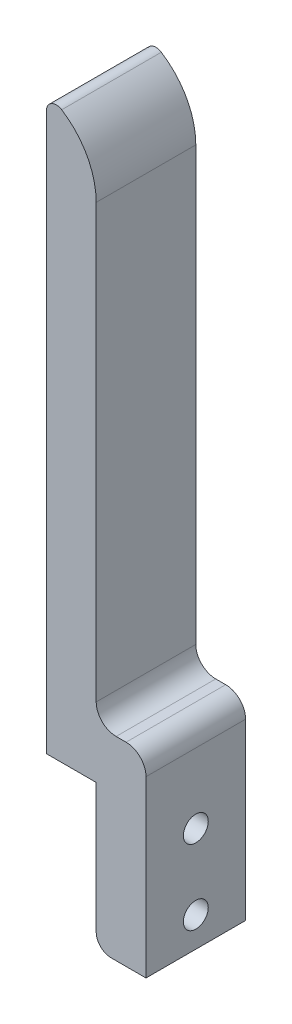
ISO-10303-21;
HEADER;
FILE_DESCRIPTION(('STEP AP214'),'2;1');
FILE_NAME('part.step','',(''),(''),'','','');
FILE_SCHEMA(('AUTOMOTIVE_DESIGN { 1 0 10303 214 1 1 1 1 }'));
ENDSEC;
DATA;
#1=APPLICATION_CONTEXT('core data for automotive mechanical design processes');
#2=APPLICATION_PROTOCOL_DEFINITION('international standard','automotive_design',2000,#1);
#3=PRODUCT_CONTEXT('',#1,'mechanical');
#4=PRODUCT('Part','Part','',(#3));
#5=PRODUCT_RELATED_PRODUCT_CATEGORY('part','',(#4));
#6=PRODUCT_DEFINITION_FORMATION('','',#4);
#7=PRODUCT_DEFINITION_CONTEXT('part definition',#1,'design');
#8=PRODUCT_DEFINITION('design','',#6,#7);
#9=PRODUCT_DEFINITION_SHAPE('','',#8);
#10=(LENGTH_UNIT() NAMED_UNIT(*) SI_UNIT(.MILLI.,.METRE.));
#11=(NAMED_UNIT(*) PLANE_ANGLE_UNIT() SI_UNIT($,.RADIAN.));
#12=(NAMED_UNIT(*) SI_UNIT($,.STERADIAN.) SOLID_ANGLE_UNIT());
#13=UNCERTAINTY_MEASURE_WITH_UNIT(LENGTH_MEASURE(1.E-05),#10,'distance_accuracy_value','');
#14=(GEOMETRIC_REPRESENTATION_CONTEXT(3) GLOBAL_UNCERTAINTY_ASSIGNED_CONTEXT((#13)) GLOBAL_UNIT_ASSIGNED_CONTEXT((#10,
#11,#12)) REPRESENTATION_CONTEXT('',''));
#15=CARTESIAN_POINT('',(0.,0.,0.));
#16=DIRECTION('',(0.,0.,1.));
#17=DIRECTION('',(1.,0.,0.));
#18=AXIS2_PLACEMENT_3D('',#15,#16,#17);
#19=CARTESIAN_POINT('',(0.,0.,20.));
#20=DIRECTION('',(1.,0.,0.));
#21=DIRECTION('',(0.,0.,-1.));
#22=AXIS2_PLACEMENT_3D('',#19,#20,#21);
#23=PLANE('',#22);
#24=DIRECTION('',(0.,-1.,0.));
#25=VECTOR('',#24,1.);
#26=CARTESIAN_POINT('',(0.,0.,0.));
#27=LINE('',#26,#25);
#28=CARTESIAN_POINT('',(0.,111.812315526372,0.));
#29=VERTEX_POINT('',#28);
#30=CARTESIAN_POINT('',(0.,0.,0.));
#31=VERTEX_POINT('',#30);
#32=EDGE_CURVE('E147',#29,#31,#27,.T.);
#33=ORIENTED_EDGE('',*,*,#32,.T.);
#34=DIRECTION('',(0.,0.,-1.));
#35=VECTOR('',#34,1.);
#36=CARTESIAN_POINT('',(0.,0.,20.));
#37=LINE('',#36,#35);
#38=CARTESIAN_POINT('',(0.,0.,20.));
#39=VERTEX_POINT('',#38);
#40=EDGE_CURVE('E129',#39,#31,#37,.T.);
#41=ORIENTED_EDGE('',*,*,#40,.F.);
#42=DIRECTION('',(0.,-1.,0.));
#43=VECTOR('',#42,1.);
#44=CARTESIAN_POINT('',(0.,0.,20.));
#45=LINE('',#44,#43);
#46=CARTESIAN_POINT('',(0.,111.812315526372,20.));
#47=VERTEX_POINT('',#46);
#48=EDGE_CURVE('E135',#47,#39,#45,.T.);
#49=ORIENTED_EDGE('',*,*,#48,.F.);
#50=DIRECTION('',(0.,0.,-1.));
#51=VECTOR('',#50,1.);
#52=CARTESIAN_POINT('',(0.,111.812315526372,20.));
#53=LINE('',#52,#51);
#54=EDGE_CURVE('E176',#47,#29,#53,.T.);
#55=ORIENTED_EDGE('',*,*,#54,.T.);
#56=EDGE_LOOP('',(#33,#41,#49,#55));
#57=FACE_BOUND('',#56,.T.);
#58=ADVANCED_FACE('F36',(#57),#23,.F.);
#59=CARTESIAN_POINT('',(0.,0.,20.));
#60=DIRECTION('',(0.,1.,0.));
#61=DIRECTION('',(0.,0.,1.));
#62=AXIS2_PLACEMENT_3D('',#59,#60,#61);
#63=PLANE('',#62);
#64=DIRECTION('',(1.,0.,0.));
#65=VECTOR('',#64,1.);
#66=CARTESIAN_POINT('',(0.,0.,0.));
#67=LINE('',#66,#65);
#68=CARTESIAN_POINT('',(10.,0.,0.));
#69=VERTEX_POINT('',#68);
#70=EDGE_CURVE('E195',#31,#69,#67,.T.);
#71=ORIENTED_EDGE('',*,*,#70,.T.);
#72=DIRECTION('',(0.,0.,-1.));
#73=VECTOR('',#72,1.);
#74=CARTESIAN_POINT('',(10.,0.,20.));
#75=LINE('',#74,#73);
#76=CARTESIAN_POINT('',(10.,0.,20.));
#77=VERTEX_POINT('',#76);
#78=EDGE_CURVE('E132',#77,#69,#75,.T.);
#79=ORIENTED_EDGE('',*,*,#78,.F.);
#80=DIRECTION('',(1.,0.,0.));
#81=VECTOR('',#80,1.);
#82=CARTESIAN_POINT('',(0.,0.,20.));
#83=LINE('',#82,#81);
#84=EDGE_CURVE('E125',#39,#77,#83,.T.);
#85=ORIENTED_EDGE('',*,*,#84,.F.);
#86=ORIENTED_EDGE('',*,*,#40,.T.);
#87=EDGE_LOOP('',(#71,#79,#85,#86));
#88=FACE_BOUND('',#87,.T.);
#89=ADVANCED_FACE('F127',(#88),#63,.F.);
#90=CARTESIAN_POINT('',(10.,0.,20.));
#91=DIRECTION('',(1.,0.,0.));
#92=DIRECTION('',(0.,1.,0.));
#93=AXIS2_PLACEMENT_3D('',#90,#91,#92);
#94=PLANE('',#93);
#95=CARTESIAN_POINT('',(10.,-23.,10.));
#96=DIRECTION('',(1.,0.,0.));
#97=DIRECTION('',(0.,1.,0.));
#98=AXIS2_PLACEMENT_3D('',#95,#96,#97);
#99=CIRCLE('',#98,2.5);
#100=CARTESIAN_POINT('',(10.,-20.5,10.));
#101=VERTEX_POINT('',#100);
#102=EDGE_CURVE('E220',#101,#101,#99,.T.);
#103=ORIENTED_EDGE('',*,*,#102,.T.);
#104=EDGE_LOOP('',(#103));
#105=FACE_BOUND('',#104,.T.);
#106=CARTESIAN_POINT('',(10.,-8.,10.));
#107=DIRECTION('',(1.,0.,0.));
#108=DIRECTION('',(0.,1.,0.));
#109=AXIS2_PLACEMENT_3D('',#106,#107,#108);
#110=CIRCLE('',#109,2.5);
#111=CARTESIAN_POINT('',(10.,-5.5,10.));
#112=VERTEX_POINT('',#111);
#113=EDGE_CURVE('E198',#112,#112,#110,.T.);
#114=ORIENTED_EDGE('',*,*,#113,.T.);
#115=EDGE_LOOP('',(#114));
#116=FACE_BOUND('',#115,.T.);
#117=DIRECTION('',(0.,-1.,0.));
#118=VECTOR('',#117,1.);
#119=CARTESIAN_POINT('',(10.,0.,0.));
#120=LINE('',#119,#118);
#121=CARTESIAN_POINT('',(10.,-26.,0.));
#122=VERTEX_POINT('',#121);
#123=EDGE_CURVE('E193',#69,#122,#120,.T.);
#124=ORIENTED_EDGE('',*,*,#123,.T.);
#125=DIRECTION('',(0.,0.,-1.));
#126=VECTOR('',#125,1.);
#127=CARTESIAN_POINT('',(10.,-26.,20.));
#128=LINE('',#127,#126);
#129=CARTESIAN_POINT('',(10.,-26.,20.));
#130=VERTEX_POINT('',#129);
#131=EDGE_CURVE('E44',#122,#130,#128,.F.);
#132=ORIENTED_EDGE('',*,*,#131,.T.);
#133=DIRECTION('',(0.,-1.,0.));
#134=VECTOR('',#133,1.);
#135=CARTESIAN_POINT('',(10.,0.,20.));
#136=LINE('',#135,#134);
#137=EDGE_CURVE('E134',#77,#130,#136,.T.);
#138=ORIENTED_EDGE('',*,*,#137,.F.);
#139=ORIENTED_EDGE('',*,*,#78,.T.);
#140=EDGE_LOOP('',(#124,#132,#138,#139));
#141=FACE_BOUND('',#140,.T.);
#142=ADVANCED_FACE('F275',(#105,#116,#141),#94,.F.);
#143=CARTESIAN_POINT('',(10.,-29.,20.));
#144=DIRECTION('',(0.,1.,0.));
#145=DIRECTION('',(0.,0.,1.));
#146=AXIS2_PLACEMENT_3D('',#143,#144,#145);
#147=PLANE('',#146);
#148=DIRECTION('',(1.,0.,0.));
#149=VECTOR('',#148,1.);
#150=CARTESIAN_POINT('',(10.,-29.,20.));
#151=LINE('',#150,#149);
#152=CARTESIAN_POINT('',(13.,-29.,20.));
#153=VERTEX_POINT('',#152);
#154=CARTESIAN_POINT('',(20.,-29.,20.));
#155=VERTEX_POINT('',#154);
#156=EDGE_CURVE('E212',#153,#155,#151,.T.);
#157=ORIENTED_EDGE('',*,*,#156,.F.);
#158=DIRECTION('',(0.,0.,-1.));
#159=VECTOR('',#158,1.);
#160=CARTESIAN_POINT('',(13.,-29.,20.));
#161=LINE('',#160,#159);
#162=CARTESIAN_POINT('',(13.,-29.,0.));
#163=VERTEX_POINT('',#162);
#164=EDGE_CURVE('E148',#153,#163,#161,.T.);
#165=ORIENTED_EDGE('',*,*,#164,.T.);
#166=DIRECTION('',(1.,0.,0.));
#167=VECTOR('',#166,1.);
#168=CARTESIAN_POINT('',(10.,-29.,0.));
#169=LINE('',#168,#167);
#170=CARTESIAN_POINT('',(20.,-29.,0.));
#171=VERTEX_POINT('',#170);
#172=EDGE_CURVE('E191',#163,#171,#169,.T.);
#173=ORIENTED_EDGE('',*,*,#172,.T.);
#174=DIRECTION('',(0.,0.,-1.));
#175=VECTOR('',#174,1.);
#176=CARTESIAN_POINT('',(20.,-29.,20.));
#177=LINE('',#176,#175);
#178=EDGE_CURVE('E152',#155,#171,#177,.T.);
#179=ORIENTED_EDGE('',*,*,#178,.F.);
#180=EDGE_LOOP('',(#157,#165,#173,#179));
#181=FACE_BOUND('',#180,.T.);
#182=ADVANCED_FACE('F234',(#181),#147,.F.);
#183=CARTESIAN_POINT('',(20.,-29.,20.));
#184=DIRECTION('',(-1.,0.,0.));
#185=DIRECTION('',(0.,0.,1.));
#186=AXIS2_PLACEMENT_3D('',#183,#184,#185);
#187=PLANE('',#186);
#188=CARTESIAN_POINT('',(20.,-23.,10.));
#189=DIRECTION('',(1.,0.,0.));
#190=DIRECTION('',(0.,0.,-1.));
#191=AXIS2_PLACEMENT_3D('',#188,#189,#190);
#192=CIRCLE('',#191,2.5);
#193=CARTESIAN_POINT('',(20.,-23.,7.5));
#194=VERTEX_POINT('',#193);
#195=EDGE_CURVE('E223',#194,#194,#192,.T.);
#196=ORIENTED_EDGE('',*,*,#195,.F.);
#197=EDGE_LOOP('',(#196));
#198=FACE_BOUND('',#197,.T.);
#199=CARTESIAN_POINT('',(20.,-8.,10.));
#200=DIRECTION('',(1.,0.,0.));
#201=DIRECTION('',(0.,0.,-1.));
#202=AXIS2_PLACEMENT_3D('',#199,#200,#201);
#203=CIRCLE('',#202,2.5);
#204=CARTESIAN_POINT('',(20.,-8.,7.5));
#205=VERTEX_POINT('',#204);
#206=EDGE_CURVE('E217',#205,#205,#203,.T.);
#207=ORIENTED_EDGE('',*,*,#206,.F.);
#208=EDGE_LOOP('',(#207));
#209=FACE_BOUND('',#208,.T.);
#210=DIRECTION('',(0.,1.,0.));
#211=VECTOR('',#210,1.);
#212=CARTESIAN_POINT('',(20.,-29.,0.));
#213=LINE('',#212,#211);
#214=CARTESIAN_POINT('',(20.,5.99999999999997,0.));
#215=VERTEX_POINT('',#214);
#216=EDGE_CURVE('E189',#171,#215,#213,.T.);
#217=ORIENTED_EDGE('',*,*,#216,.T.);
#218=DIRECTION('',(0.,0.,-1.));
#219=VECTOR('',#218,1.);
#220=CARTESIAN_POINT('',(20.,5.99999999999997,20.));
#221=LINE('',#220,#219);
#222=CARTESIAN_POINT('',(20.,5.99999999999997,20.));
#223=VERTEX_POINT('',#222);
#224=EDGE_CURVE('E158',#223,#215,#221,.T.);
#225=ORIENTED_EDGE('',*,*,#224,.F.);
#226=DIRECTION('',(0.,1.,0.));
#227=VECTOR('',#226,1.);
#228=CARTESIAN_POINT('',(20.,-29.,20.));
#229=LINE('',#228,#227);
#230=EDGE_CURVE('E210',#155,#223,#229,.T.);
#231=ORIENTED_EDGE('',*,*,#230,.F.);
#232=ORIENTED_EDGE('',*,*,#178,.T.);
#233=EDGE_LOOP('',(#217,#225,#231,#232));
#234=FACE_BOUND('',#233,.T.);
#235=ADVANCED_FACE('F230',(#198,#209,#234),#187,.F.);
#236=CARTESIAN_POINT('',(16.,6.,20.));
#237=DIRECTION('',(0.,0.,-1.));
#238=DIRECTION('',(-1.,0.,0.));
#239=AXIS2_PLACEMENT_3D('',#236,#237,#238);
#240=CYLINDRICAL_SURFACE('',#239,4.);
#241=CARTESIAN_POINT('',(16.,6.,0.));
#242=DIRECTION('',(0.,0.,1.));
#243=DIRECTION('',(1.,0.,0.));
#244=AXIS2_PLACEMENT_3D('',#241,#242,#243);
#245=CIRCLE('',#244,4.);
#246=CARTESIAN_POINT('',(16.,10.,0.));
#247=VERTEX_POINT('',#246);
#248=EDGE_CURVE('E187',#215,#247,#245,.T.);
#249=ORIENTED_EDGE('',*,*,#248,.T.);
#250=DIRECTION('',(0.,0.,-1.));
#251=VECTOR('',#250,1.);
#252=CARTESIAN_POINT('',(16.,10.,20.));
#253=LINE('',#252,#251);
#254=CARTESIAN_POINT('',(16.,10.,20.));
#255=VERTEX_POINT('',#254);
#256=EDGE_CURVE('E161',#255,#247,#253,.T.);
#257=ORIENTED_EDGE('',*,*,#256,.F.);
#258=CARTESIAN_POINT('',(16.,6.,20.));
#259=DIRECTION('',(0.,0.,1.));
#260=DIRECTION('',(1.,0.,0.));
#261=AXIS2_PLACEMENT_3D('',#258,#259,#260);
#262=CIRCLE('',#261,4.);
#263=EDGE_CURVE('E208',#223,#255,#262,.T.);
#264=ORIENTED_EDGE('',*,*,#263,.F.);
#265=ORIENTED_EDGE('',*,*,#224,.T.);
#266=EDGE_LOOP('',(#249,#257,#264,#265));
#267=FACE_BOUND('',#266,.T.);
#268=ADVANCED_FACE('F233',(#267),#240,.T.);
#269=CARTESIAN_POINT('',(16.,10.,20.));
#270=DIRECTION('',(0.,-1.,0.));
#271=DIRECTION('',(0.,0.,-1.));
#272=AXIS2_PLACEMENT_3D('',#269,#270,#271);
#273=PLANE('',#272);
#274=DIRECTION('',(-1.,0.,0.));
#275=VECTOR('',#274,1.);
#276=CARTESIAN_POINT('',(16.,10.,0.));
#277=LINE('',#276,#275);
#278=CARTESIAN_POINT('',(14.,10.,0.));
#279=VERTEX_POINT('',#278);
#280=EDGE_CURVE('E185',#247,#279,#277,.T.);
#281=ORIENTED_EDGE('',*,*,#280,.T.);
#282=DIRECTION('',(0.,0.,-1.));
#283=VECTOR('',#282,1.);
#284=CARTESIAN_POINT('',(14.,10.,20.));
#285=LINE('',#284,#283);
#286=CARTESIAN_POINT('',(14.,10.,20.));
#287=VERTEX_POINT('',#286);
#288=EDGE_CURVE('E164',#287,#279,#285,.T.);
#289=ORIENTED_EDGE('',*,*,#288,.F.);
#290=DIRECTION('',(-1.,0.,0.));
#291=VECTOR('',#290,1.);
#292=CARTESIAN_POINT('',(16.,10.,20.));
#293=LINE('',#292,#291);
#294=EDGE_CURVE('E206',#255,#287,#293,.T.);
#295=ORIENTED_EDGE('',*,*,#294,.F.);
#296=ORIENTED_EDGE('',*,*,#256,.T.);
#297=EDGE_LOOP('',(#281,#289,#295,#296));
#298=FACE_BOUND('',#297,.T.);
#299=ADVANCED_FACE('F252',(#298),#273,.F.);
#300=CARTESIAN_POINT('',(14.,14.,20.));
#301=DIRECTION('',(0.,0.,-1.));
#302=DIRECTION('',(-1.,0.,0.));
#303=AXIS2_PLACEMENT_3D('',#300,#301,#302);
#304=CYLINDRICAL_SURFACE('',#303,4.);
#305=CARTESIAN_POINT('',(14.,14.,0.));
#306=DIRECTION('',(0.,0.,-1.));
#307=DIRECTION('',(-1.,0.,0.));
#308=AXIS2_PLACEMENT_3D('',#305,#306,#307);
#309=CIRCLE('',#308,4.);
#310=CARTESIAN_POINT('',(10.,14.,0.));
#311=VERTEX_POINT('',#310);
#312=EDGE_CURVE('E183',#279,#311,#309,.T.);
#313=ORIENTED_EDGE('',*,*,#312,.T.);
#314=DIRECTION('',(0.,0.,-1.));
#315=VECTOR('',#314,1.);
#316=CARTESIAN_POINT('',(10.,14.,20.));
#317=LINE('',#316,#315);
#318=CARTESIAN_POINT('',(10.,14.,20.));
#319=VERTEX_POINT('',#318);
#320=EDGE_CURVE('E167',#319,#311,#317,.T.);
#321=ORIENTED_EDGE('',*,*,#320,.F.);
#322=CARTESIAN_POINT('',(14.,14.,20.));
#323=DIRECTION('',(0.,0.,-1.));
#324=DIRECTION('',(-1.,0.,0.));
#325=AXIS2_PLACEMENT_3D('',#322,#323,#324);
#326=CIRCLE('',#325,4.);
#327=EDGE_CURVE('E204',#287,#319,#326,.T.);
#328=ORIENTED_EDGE('',*,*,#327,.F.);
#329=ORIENTED_EDGE('',*,*,#288,.T.);
#330=EDGE_LOOP('',(#313,#321,#328,#329));
#331=FACE_BOUND('',#330,.T.);
#332=ADVANCED_FACE('F256',(#331),#304,.F.);
#333=CARTESIAN_POINT('',(10.,14.,20.));
#334=DIRECTION('',(-1.,0.,0.));
#335=DIRECTION('',(0.,0.,1.));
#336=AXIS2_PLACEMENT_3D('',#333,#334,#335);
#337=PLANE('',#336);
#338=DIRECTION('',(0.,1.,0.));
#339=VECTOR('',#338,1.);
#340=CARTESIAN_POINT('',(10.,14.,0.));
#341=LINE('',#340,#339);
#342=CARTESIAN_POINT('',(10.,100.857864376269,0.));
#343=VERTEX_POINT('',#342);
#344=EDGE_CURVE('E181',#311,#343,#341,.T.);
#345=ORIENTED_EDGE('',*,*,#344,.T.);
#346=DIRECTION('',(0.,0.,-1.));
#347=VECTOR('',#346,1.);
#348=CARTESIAN_POINT('',(10.,100.857864376269,20.));
#349=LINE('',#348,#347);
#350=CARTESIAN_POINT('',(10.,100.857864376269,20.));
#351=VERTEX_POINT('',#350);
#352=EDGE_CURVE('E170',#351,#343,#349,.T.);
#353=ORIENTED_EDGE('',*,*,#352,.F.);
#354=DIRECTION('',(0.,1.,0.));
#355=VECTOR('',#354,1.);
#356=CARTESIAN_POINT('',(10.,14.,20.));
#357=LINE('',#356,#355);
#358=EDGE_CURVE('E202',#319,#351,#357,.T.);
#359=ORIENTED_EDGE('',*,*,#358,.F.);
#360=ORIENTED_EDGE('',*,*,#320,.T.);
#361=EDGE_LOOP('',(#345,#353,#359,#360));
#362=FACE_BOUND('',#361,.T.);
#363=ADVANCED_FACE('F289',(#362),#337,.F.);
#364=CARTESIAN_POINT('',(-5.,100.857864376269,20.));
#365=DIRECTION('',(0.,0.,-1.));
#366=DIRECTION('',(-1.,0.,0.));
#367=AXIS2_PLACEMENT_3D('',#364,#365,#366);
#368=CYLINDRICAL_SURFACE('',#367,15.);
#369=CARTESIAN_POINT('',(-5.,100.857864376269,0.));
#370=DIRECTION('',(0.,0.,1.));
#371=DIRECTION('',(1.,0.,0.));
#372=AXIS2_PLACEMENT_3D('',#369,#370,#371);
#373=CIRCLE('',#372,15.);
#374=CARTESIAN_POINT('',(3.07692307692307,113.497615703311,0.));
#375=VERTEX_POINT('',#374);
#376=EDGE_CURVE('E179',#343,#375,#373,.T.);
#377=ORIENTED_EDGE('',*,*,#376,.T.);
#378=DIRECTION('',(0.,0.,-1.));
#379=VECTOR('',#378,1.);
#380=CARTESIAN_POINT('',(3.07692307692307,113.497615703311,20.));
#381=LINE('',#380,#379);
#382=CARTESIAN_POINT('',(3.07692307692307,113.497615703311,20.));
#383=VERTEX_POINT('',#382);
#384=EDGE_CURVE('E173',#383,#375,#381,.T.);
#385=ORIENTED_EDGE('',*,*,#384,.F.);
#386=CARTESIAN_POINT('',(-5.,100.857864376269,20.));
#387=DIRECTION('',(0.,0.,1.));
#388=DIRECTION('',(1.,0.,0.));
#389=AXIS2_PLACEMENT_3D('',#386,#387,#388);
#390=CIRCLE('',#389,15.);
#391=EDGE_CURVE('E200',#351,#383,#390,.T.);
#392=ORIENTED_EDGE('',*,*,#391,.F.);
#393=ORIENTED_EDGE('',*,*,#352,.T.);
#394=EDGE_LOOP('',(#377,#385,#392,#393));
#395=FACE_BOUND('',#394,.T.);
#396=ADVANCED_FACE('F292',(#395),#368,.T.);
#397=CARTESIAN_POINT('',(2.,111.812315526372,20.));
#398=DIRECTION('',(0.,0.,-1.));
#399=DIRECTION('',(-1.,0.,0.));
#400=AXIS2_PLACEMENT_3D('',#397,#398,#399);
#401=CYLINDRICAL_SURFACE('',#400,2.);
#402=CARTESIAN_POINT('',(2.,111.812315526372,0.));
#403=DIRECTION('',(0.,0.,1.));
#404=DIRECTION('',(-1.,0.,0.));
#405=AXIS2_PLACEMENT_3D('',#402,#403,#404);
#406=CIRCLE('',#405,2.);
#407=EDGE_CURVE('E144',#375,#29,#406,.T.);
#408=ORIENTED_EDGE('',*,*,#407,.T.);
#409=ORIENTED_EDGE('',*,*,#54,.F.);
#410=CARTESIAN_POINT('',(2.,111.812315526372,20.));
#411=DIRECTION('',(0.,0.,1.));
#412=DIRECTION('',(-1.,0.,0.));
#413=AXIS2_PLACEMENT_3D('',#410,#411,#412);
#414=CIRCLE('',#413,2.);
#415=EDGE_CURVE('E140',#383,#47,#414,.T.);
#416=ORIENTED_EDGE('',*,*,#415,.F.);
#417=ORIENTED_EDGE('',*,*,#384,.T.);
#418=EDGE_LOOP('',(#408,#409,#416,#417));
#419=FACE_BOUND('',#418,.T.);
#420=ADVANCED_FACE('F296',(#419),#401,.T.);
#421=CARTESIAN_POINT('',(2.,111.812315526372,20.));
#422=DIRECTION('',(0.,0.,-1.));
#423=DIRECTION('',(-1.,0.,0.));
#424=AXIS2_PLACEMENT_3D('',#421,#422,#423);
#425=PLANE('',#424);
#426=ORIENTED_EDGE('',*,*,#137,.T.);
#427=CARTESIAN_POINT('',(13.,-26.,20.));
#428=DIRECTION('',(0.,0.,-1.));
#429=DIRECTION('',(-1.,0.,0.));
#430=AXIS2_PLACEMENT_3D('',#427,#428,#429);
#431=CIRCLE('',#430,3.);
#432=EDGE_CURVE('E11',#130,#153,#431,.F.);
#433=ORIENTED_EDGE('',*,*,#432,.T.);
#434=ORIENTED_EDGE('',*,*,#156,.T.);
#435=ORIENTED_EDGE('',*,*,#230,.T.);
#436=ORIENTED_EDGE('',*,*,#263,.T.);
#437=ORIENTED_EDGE('',*,*,#294,.T.);
#438=ORIENTED_EDGE('',*,*,#327,.T.);
#439=ORIENTED_EDGE('',*,*,#358,.T.);
#440=ORIENTED_EDGE('',*,*,#391,.T.);
#441=ORIENTED_EDGE('',*,*,#415,.T.);
#442=ORIENTED_EDGE('',*,*,#48,.T.);
#443=ORIENTED_EDGE('',*,*,#84,.T.);
#444=EDGE_LOOP('',(#426,#433,#434,#435,#436,#437,#438,#439,#440,#441,#442,#443));
#445=FACE_BOUND('',#444,.T.);
#446=ADVANCED_FACE('F138',(#445),#425,.F.);
#447=CARTESIAN_POINT('',(2.,111.812315526372,0.));
#448=DIRECTION('',(0.,0.,-1.));
#449=DIRECTION('',(-1.,0.,0.));
#450=AXIS2_PLACEMENT_3D('',#447,#448,#449);
#451=PLANE('',#450);
#452=ORIENTED_EDGE('',*,*,#172,.F.);
#453=CARTESIAN_POINT('',(13.,-26.,0.));
#454=DIRECTION('',(0.,0.,-1.));
#455=DIRECTION('',(-1.,0.,0.));
#456=AXIS2_PLACEMENT_3D('',#453,#454,#455);
#457=CIRCLE('',#456,3.);
#458=EDGE_CURVE('E58',#163,#122,#457,.T.);
#459=ORIENTED_EDGE('',*,*,#458,.T.);
#460=ORIENTED_EDGE('',*,*,#123,.F.);
#461=ORIENTED_EDGE('',*,*,#70,.F.);
#462=ORIENTED_EDGE('',*,*,#32,.F.);
#463=ORIENTED_EDGE('',*,*,#407,.F.);
#464=ORIENTED_EDGE('',*,*,#376,.F.);
#465=ORIENTED_EDGE('',*,*,#344,.F.);
#466=ORIENTED_EDGE('',*,*,#312,.F.);
#467=ORIENTED_EDGE('',*,*,#280,.F.);
#468=ORIENTED_EDGE('',*,*,#248,.F.);
#469=ORIENTED_EDGE('',*,*,#216,.F.);
#470=EDGE_LOOP('',(#452,#459,#460,#461,#462,#463,#464,#465,#466,#467,#468,#469));
#471=FACE_BOUND('',#470,.T.);
#472=ADVANCED_FACE('F247',(#471),#451,.T.);
#473=CARTESIAN_POINT('',(0.,-8.,10.));
#474=DIRECTION('',(1.,0.,0.));
#475=DIRECTION('',(0.,0.,-1.));
#476=AXIS2_PLACEMENT_3D('',#473,#474,#475);
#477=CYLINDRICAL_SURFACE('',#476,2.5);
#478=ORIENTED_EDGE('',*,*,#206,.T.);
#479=EDGE_LOOP('',(#478));
#480=FACE_BOUND('',#479,.T.);
#481=ORIENTED_EDGE('',*,*,#113,.F.);
#482=EDGE_LOOP('',(#481));
#483=FACE_BOUND('',#482,.T.);
#484=ADVANCED_FACE('F269',(#480,#483),#477,.F.);
#485=CARTESIAN_POINT('',(0.,-23.,10.));
#486=DIRECTION('',(1.,0.,0.));
#487=DIRECTION('',(0.,0.,-1.));
#488=AXIS2_PLACEMENT_3D('',#485,#486,#487);
#489=CYLINDRICAL_SURFACE('',#488,2.5);
#490=ORIENTED_EDGE('',*,*,#195,.T.);
#491=EDGE_LOOP('',(#490));
#492=FACE_BOUND('',#491,.T.);
#493=ORIENTED_EDGE('',*,*,#102,.F.);
#494=EDGE_LOOP('',(#493));
#495=FACE_BOUND('',#494,.T.);
#496=ADVANCED_FACE('F227',(#492,#495),#489,.F.);
#497=CARTESIAN_POINT('',(13.,-26.,20.));
#498=DIRECTION('',(0.,0.,-1.));
#499=DIRECTION('',(-1.,0.,0.));
#500=AXIS2_PLACEMENT_3D('',#497,#498,#499);
#501=CYLINDRICAL_SURFACE('',#500,3.);
#502=ORIENTED_EDGE('',*,*,#432,.F.);
#503=ORIENTED_EDGE('',*,*,#131,.F.);
#504=ORIENTED_EDGE('',*,*,#458,.F.);
#505=ORIENTED_EDGE('',*,*,#164,.F.);
#506=EDGE_LOOP('',(#502,#503,#504,#505));
#507=FACE_BOUND('',#506,.T.);
#508=ADVANCED_FACE('F38',(#507),#501,.T.);
#509=CLOSED_SHELL('',(#58,#89,#142,#182,#235,#268,#299,#332,#363,#396,#420,#446,#472,#484,#496,#508));
#510=MANIFOLD_SOLID_BREP('B2',#509);
#511=ADVANCED_BREP_SHAPE_REPRESENTATION('',(#18,#510),#14);
#512=SHAPE_DEFINITION_REPRESENTATION(#9,#511);
ENDSEC;
END-ISO-10303-21;
